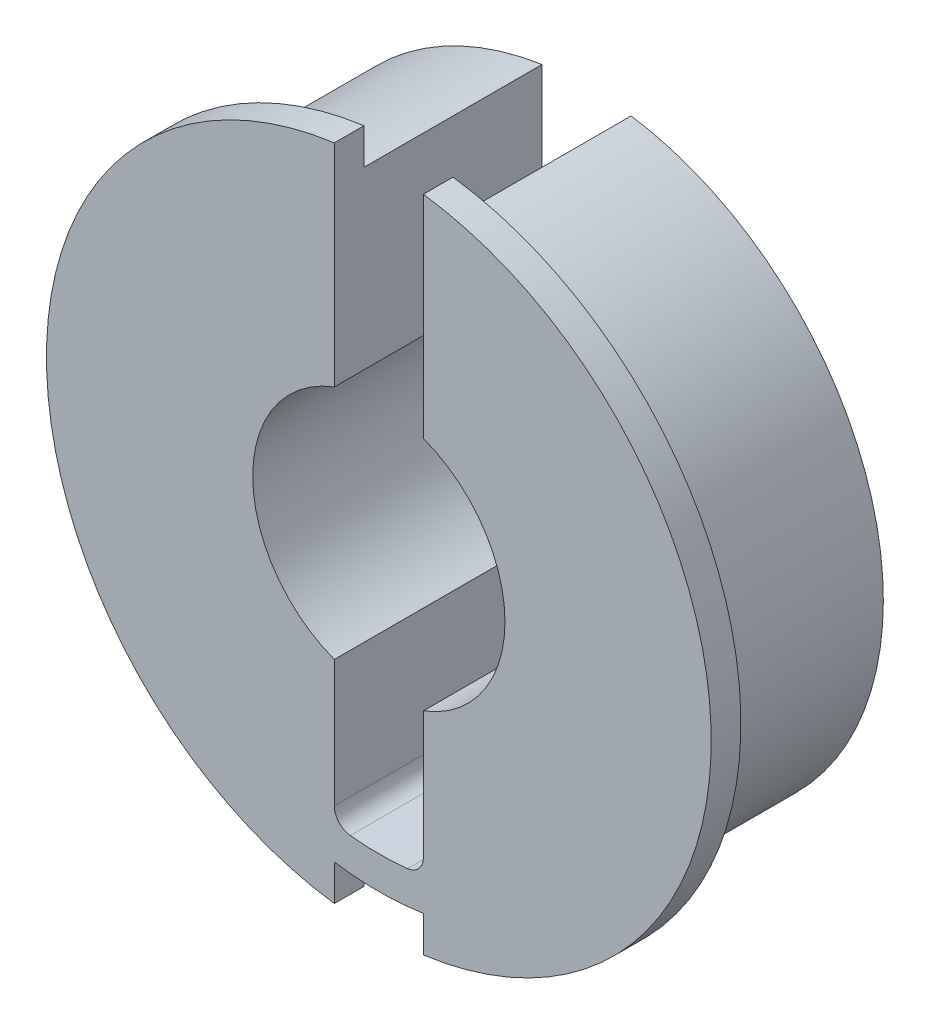
ISO-10303-21;
HEADER;
FILE_DESCRIPTION(('STEP AP214'),'2;1');
FILE_NAME('part.step','',(''),(''),'','','');
FILE_SCHEMA(('AUTOMOTIVE_DESIGN { 1 0 10303 214 1 1 1 1 }'));
ENDSEC;
DATA;
#1=APPLICATION_CONTEXT('core data for automotive mechanical design processes');
#2=APPLICATION_PROTOCOL_DEFINITION('international standard','automotive_design',2000,#1);
#3=PRODUCT_CONTEXT('',#1,'mechanical');
#4=PRODUCT('Part','Part','',(#3));
#5=PRODUCT_RELATED_PRODUCT_CATEGORY('part','',(#4));
#6=PRODUCT_DEFINITION_FORMATION('','',#4);
#7=PRODUCT_DEFINITION_CONTEXT('part definition',#1,'design');
#8=PRODUCT_DEFINITION('design','',#6,#7);
#9=PRODUCT_DEFINITION_SHAPE('','',#8);
#10=(LENGTH_UNIT() NAMED_UNIT(*) SI_UNIT(.MILLI.,.METRE.));
#11=(NAMED_UNIT(*) PLANE_ANGLE_UNIT() SI_UNIT($,.RADIAN.));
#12=(NAMED_UNIT(*) SI_UNIT($,.STERADIAN.) SOLID_ANGLE_UNIT());
#13=UNCERTAINTY_MEASURE_WITH_UNIT(LENGTH_MEASURE(1.E-05),#10,'distance_accuracy_value','');
#14=(GEOMETRIC_REPRESENTATION_CONTEXT(3) GLOBAL_UNCERTAINTY_ASSIGNED_CONTEXT((#13)) GLOBAL_UNIT_ASSIGNED_CONTEXT((#10,
#11,#12)) REPRESENTATION_CONTEXT('',''));
#15=CARTESIAN_POINT('',(0.,0.,0.));
#16=DIRECTION('',(0.,0.,1.));
#17=DIRECTION('',(1.,0.,0.));
#18=AXIS2_PLACEMENT_3D('',#15,#16,#17);
#19=CARTESIAN_POINT('',(0.,0.,7.62));
#20=DIRECTION('',(0.,0.,1.));
#21=DIRECTION('',(1.,0.,0.));
#22=AXIS2_PLACEMENT_3D('',#19,#20,#21);
#23=PLANE('',#22);
#24=CARTESIAN_POINT('',(0.,0.,7.62));
#25=DIRECTION('',(0.,0.,1.));
#26=DIRECTION('',(1.,0.,0.));
#27=AXIS2_PLACEMENT_3D('',#24,#25,#26);
#28=CIRCLE('',#27,14.224);
#29=CARTESIAN_POINT('',(1.905,-14.0958558094214,7.62));
#30=VERTEX_POINT('',#29);
#31=CARTESIAN_POINT('',(1.905,14.0958558094214,7.62));
#32=VERTEX_POINT('',#31);
#33=EDGE_CURVE('E227',#30,#32,#28,.T.);
#34=ORIENTED_EDGE('',*,*,#33,.F.);
#35=DIRECTION('',(0.,-1.,0.));
#36=VECTOR('',#35,1.);
#37=CARTESIAN_POINT('',(1.905,-14.224,7.62));
#38=LINE('',#37,#36);
#39=CARTESIAN_POINT('',(1.905,-12.5563121576361,7.62));
#40=VERTEX_POINT('',#39);
#41=EDGE_CURVE('E171',#40,#30,#38,.T.);
#42=ORIENTED_EDGE('',*,*,#41,.F.);
#43=CARTESIAN_POINT('',(0.,0.,7.62));
#44=DIRECTION('',(0.,0.,1.));
#45=DIRECTION('',(1.,0.,0.));
#46=AXIS2_PLACEMENT_3D('',#43,#44,#45);
#47=CIRCLE('',#46,12.7);
#48=CARTESIAN_POINT('',(1.905,12.5563121576361,7.62));
#49=VERTEX_POINT('',#48);
#50=EDGE_CURVE('E234',#40,#49,#47,.T.);
#51=ORIENTED_EDGE('',*,*,#50,.T.);
#52=DIRECTION('',(0.,1.,0.));
#53=VECTOR('',#52,1.);
#54=CARTESIAN_POINT('',(1.905,0.,7.62));
#55=LINE('',#54,#53);
#56=EDGE_CURVE('E188',#49,#32,#55,.T.);
#57=ORIENTED_EDGE('',*,*,#56,.T.);
#58=EDGE_LOOP('',(#34,#42,#51,#57));
#59=FACE_BOUND('',#58,.T.);
#60=ADVANCED_FACE('F33',(#59),#23,.F.);
#61=CARTESIAN_POINT('',(0.,0.,8.89));
#62=DIRECTION('',(0.,0.,-1.));
#63=DIRECTION('',(-1.,0.,0.));
#64=AXIS2_PLACEMENT_3D('',#61,#62,#63);
#65=CYLINDRICAL_SURFACE('',#64,14.224);
#66=CARTESIAN_POINT('',(0.,0.,8.89));
#67=DIRECTION('',(0.,0.,1.));
#68=DIRECTION('',(1.,0.,0.));
#69=AXIS2_PLACEMENT_3D('',#66,#67,#68);
#70=CIRCLE('',#69,14.224);
#71=CARTESIAN_POINT('',(1.905,-14.0958558094214,8.89));
#72=VERTEX_POINT('',#71);
#73=CARTESIAN_POINT('',(1.905,14.0958558094214,8.89));
#74=VERTEX_POINT('',#73);
#75=EDGE_CURVE('E223',#72,#74,#70,.T.);
#76=ORIENTED_EDGE('',*,*,#75,.F.);
#77=DIRECTION('',(0.,0.,-1.));
#78=VECTOR('',#77,1.);
#79=CARTESIAN_POINT('',(1.905,-14.0958558094214,8.89));
#80=LINE('',#79,#78);
#81=EDGE_CURVE('E245',#72,#30,#80,.T.);
#82=ORIENTED_EDGE('',*,*,#81,.T.);
#83=ORIENTED_EDGE('',*,*,#33,.T.);
#84=DIRECTION('',(0.,0.,-1.));
#85=VECTOR('',#84,1.);
#86=CARTESIAN_POINT('',(1.905,14.0958558094214,8.89));
#87=LINE('',#86,#85);
#88=EDGE_CURVE('E233',#32,#74,#87,.F.);
#89=ORIENTED_EDGE('',*,*,#88,.T.);
#90=EDGE_LOOP('',(#76,#82,#83,#89));
#91=FACE_BOUND('',#90,.T.);
#92=ADVANCED_FACE('F305',(#91),#65,.T.);
#93=CARTESIAN_POINT('',(0.,0.,7.62));
#94=DIRECTION('',(0.,0.,-1.));
#95=DIRECTION('',(-1.,0.,0.));
#96=AXIS2_PLACEMENT_3D('',#93,#94,#95);
#97=CYLINDRICAL_SURFACE('',#96,5.3975);
#98=DIRECTION('',(0.,0.,-1.));
#99=VECTOR('',#98,1.);
#100=CARTESIAN_POINT('',(-1.905,5.05014665628633,7.62));
#101=LINE('',#100,#99);
#102=CARTESIAN_POINT('',(-1.905,5.05014665628633,8.89));
#103=VERTEX_POINT('',#102);
#104=CARTESIAN_POINT('',(-1.905,5.05014665628633,0.));
#105=VERTEX_POINT('',#104);
#106=EDGE_CURVE('E215',#103,#105,#101,.T.);
#107=ORIENTED_EDGE('',*,*,#106,.F.);
#108=CARTESIAN_POINT('',(0.,0.,8.89));
#109=DIRECTION('',(0.,0.,1.));
#110=DIRECTION('',(1.,0.,0.));
#111=AXIS2_PLACEMENT_3D('',#108,#109,#110);
#112=CIRCLE('',#111,5.3975);
#113=CARTESIAN_POINT('',(-1.905,-5.05014665628632,8.89));
#114=VERTEX_POINT('',#113);
#115=EDGE_CURVE('E220',#103,#114,#112,.T.);
#116=ORIENTED_EDGE('',*,*,#115,.T.);
#117=DIRECTION('',(0.,0.,-1.));
#118=VECTOR('',#117,1.);
#119=CARTESIAN_POINT('',(-1.905,-5.05014665628633,7.62));
#120=LINE('',#119,#118);
#121=CARTESIAN_POINT('',(-1.905,-5.05014665628633,0.));
#122=VERTEX_POINT('',#121);
#123=EDGE_CURVE('E212',#122,#114,#120,.F.);
#124=ORIENTED_EDGE('',*,*,#123,.F.);
#125=CARTESIAN_POINT('',(0.,0.,0.));
#126=DIRECTION('',(0.,0.,1.));
#127=DIRECTION('',(1.,0.,0.));
#128=AXIS2_PLACEMENT_3D('',#125,#126,#127);
#129=CIRCLE('',#128,5.3975);
#130=EDGE_CURVE('E230',#105,#122,#129,.T.);
#131=ORIENTED_EDGE('',*,*,#130,.F.);
#132=EDGE_LOOP('',(#107,#116,#124,#131));
#133=FACE_BOUND('',#132,.T.);
#134=ADVANCED_FACE('F326',(#133),#97,.F.);
#135=CARTESIAN_POINT('',(0.,0.,0.));
#136=DIRECTION('',(0.,0.,1.));
#137=DIRECTION('',(1.,0.,0.));
#138=AXIS2_PLACEMENT_3D('',#135,#136,#137);
#139=PLANE('',#138);
#140=CARTESIAN_POINT('',(0.,0.,0.));
#141=DIRECTION('',(0.,0.,1.));
#142=DIRECTION('',(1.,0.,0.));
#143=AXIS2_PLACEMENT_3D('',#140,#141,#142);
#144=CIRCLE('',#143,12.7);
#145=CARTESIAN_POINT('',(-1.905,12.5563121576361,0.));
#146=VERTEX_POINT('',#145);
#147=CARTESIAN_POINT('',(1.905,12.5563121576361,0.));
#148=VERTEX_POINT('',#147);
#149=EDGE_CURVE('E235',#146,#148,#144,.T.);
#150=ORIENTED_EDGE('',*,*,#149,.F.);
#151=DIRECTION('',(0.,1.,0.));
#152=VECTOR('',#151,1.);
#153=CARTESIAN_POINT('',(-1.905,14.224,0.));
#154=LINE('',#153,#152);
#155=EDGE_CURVE('E177',#105,#146,#154,.T.);
#156=ORIENTED_EDGE('',*,*,#155,.F.);
#157=ORIENTED_EDGE('',*,*,#130,.T.);
#158=CARTESIAN_POINT('',(-1.905,-10.478846883126,0.));
#159=VERTEX_POINT('',#158);
#160=EDGE_CURVE('E189',#159,#122,#154,.T.);
#161=ORIENTED_EDGE('',*,*,#160,.F.);
#162=CARTESIAN_POINT('',(-1.143,-10.478846883126,0.));
#163=DIRECTION('',(0.,0.,1.));
#164=DIRECTION('',(1.,0.,0.));
#165=AXIS2_PLACEMENT_3D('',#162,#163,#164);
#166=CIRCLE('',#165,0.762);
#167=CARTESIAN_POINT('',(-1.2256265060241,-11.2363538867255,0.));
#168=VERTEX_POINT('',#167);
#169=EDGE_CURVE('E257',#159,#168,#166,.T.);
#170=ORIENTED_EDGE('',*,*,#169,.T.);
#171=CARTESIAN_POINT('',(0.,1.64798730217797E-13,0.));
#172=DIRECTION('',(0.,0.,-1.));
#173=DIRECTION('',(-1.,0.,0.));
#174=AXIS2_PLACEMENT_3D('',#171,#172,#173);
#175=CIRCLE('',#174,11.3030000000002);
#176=CARTESIAN_POINT('',(1.2256265060241,-11.2363538867255,0.));
#177=VERTEX_POINT('',#176);
#178=EDGE_CURVE('E194',#177,#168,#175,.T.);
#179=ORIENTED_EDGE('',*,*,#178,.F.);
#180=CARTESIAN_POINT('',(1.143,-10.478846883126,0.));
#181=DIRECTION('',(0.,0.,1.));
#182=DIRECTION('',(1.,0.,0.));
#183=AXIS2_PLACEMENT_3D('',#180,#181,#182);
#184=CIRCLE('',#183,0.762);
#185=CARTESIAN_POINT('',(1.905,-10.478846883126,0.));
#186=VERTEX_POINT('',#185);
#187=EDGE_CURVE('E41',#177,#186,#184,.T.);
#188=ORIENTED_EDGE('',*,*,#187,.T.);
#189=DIRECTION('',(0.,-1.,0.));
#190=VECTOR('',#189,1.);
#191=CARTESIAN_POINT('',(1.905,14.224,0.));
#192=LINE('',#191,#190);
#193=CARTESIAN_POINT('',(1.905,-5.05014665628633,0.));
#194=VERTEX_POINT('',#193);
#195=EDGE_CURVE('E191',#194,#186,#192,.T.);
#196=ORIENTED_EDGE('',*,*,#195,.F.);
#197=CARTESIAN_POINT('',(1.905,5.05014665628633,0.));
#198=VERTEX_POINT('',#197);
#199=EDGE_CURVE('E222',#194,#198,#129,.T.);
#200=ORIENTED_EDGE('',*,*,#199,.T.);
#201=EDGE_CURVE('E193',#148,#198,#192,.T.);
#202=ORIENTED_EDGE('',*,*,#201,.F.);
#203=EDGE_LOOP('',(#150,#156,#157,#161,#170,#179,#188,#196,#200,#202));
#204=FACE_BOUND('',#203,.T.);
#205=ADVANCED_FACE('F274',(#204),#139,.F.);
#206=CARTESIAN_POINT('',(0.,0.,7.62));
#207=DIRECTION('',(0.,0.,-1.));
#208=DIRECTION('',(-1.,0.,0.));
#209=AXIS2_PLACEMENT_3D('',#206,#207,#208);
#210=CYLINDRICAL_SURFACE('',#209,12.7);
#211=CARTESIAN_POINT('',(-1.905,12.5563121576361,7.62));
#212=VERTEX_POINT('',#211);
#213=CARTESIAN_POINT('',(-1.905,-12.5563121576361,7.62));
#214=VERTEX_POINT('',#213);
#215=EDGE_CURVE('E231',#212,#214,#47,.T.);
#216=ORIENTED_EDGE('',*,*,#215,.F.);
#217=DIRECTION('',(0.,0.,-1.));
#218=VECTOR('',#217,1.);
#219=CARTESIAN_POINT('',(-1.905,12.5563121576361,7.62));
#220=LINE('',#219,#218);
#221=EDGE_CURVE('E209',#212,#146,#220,.T.);
#222=ORIENTED_EDGE('',*,*,#221,.T.);
#223=ORIENTED_EDGE('',*,*,#149,.T.);
#224=DIRECTION('',(0.,0.,-1.));
#225=VECTOR('',#224,1.);
#226=CARTESIAN_POINT('',(1.905,12.5563121576361,7.62));
#227=LINE('',#226,#225);
#228=EDGE_CURVE('E199',#148,#49,#227,.F.);
#229=ORIENTED_EDGE('',*,*,#228,.T.);
#230=ORIENTED_EDGE('',*,*,#50,.F.);
#231=DIRECTION('',(0.,0.,-1.));
#232=VECTOR('',#231,1.);
#233=CARTESIAN_POINT('',(1.905,-12.5563121576361,8.89));
#234=LINE('',#233,#232);
#235=CARTESIAN_POINT('',(1.905,-12.5563121576361,8.89));
#236=VERTEX_POINT('',#235);
#237=EDGE_CURVE('E155',#236,#40,#234,.T.);
#238=ORIENTED_EDGE('',*,*,#237,.F.);
#239=CARTESIAN_POINT('',(0.,0.,8.89));
#240=DIRECTION('',(0.,0.,1.));
#241=DIRECTION('',(-1.,0.,0.));
#242=AXIS2_PLACEMENT_3D('',#239,#240,#241);
#243=CIRCLE('',#242,12.7);
#244=CARTESIAN_POINT('',(-1.905,-12.5563121576361,8.89));
#245=VERTEX_POINT('',#244);
#246=EDGE_CURVE('E159',#245,#236,#243,.T.);
#247=ORIENTED_EDGE('',*,*,#246,.F.);
#248=DIRECTION('',(0.,0.,-1.));
#249=VECTOR('',#248,1.);
#250=CARTESIAN_POINT('',(-1.905,-12.5563121576361,8.89));
#251=LINE('',#250,#249);
#252=EDGE_CURVE('E144',#245,#214,#251,.T.);
#253=ORIENTED_EDGE('',*,*,#252,.T.);
#254=EDGE_LOOP('',(#216,#222,#223,#229,#230,#238,#247,#253));
#255=FACE_BOUND('',#254,.T.);
#256=ADVANCED_FACE('F160',(#255),#210,.T.);
#257=DIRECTION('',(0.,0.,-1.));
#258=VECTOR('',#257,1.);
#259=CARTESIAN_POINT('',(1.905,-5.05014665628633,7.62));
#260=LINE('',#259,#258);
#261=CARTESIAN_POINT('',(1.905,-5.05014665628632,8.89));
#262=VERTEX_POINT('',#261);
#263=EDGE_CURVE('E204',#262,#194,#260,.T.);
#264=ORIENTED_EDGE('',*,*,#263,.F.);
#265=CARTESIAN_POINT('',(1.905,5.05014665628633,8.89));
#266=VERTEX_POINT('',#265);
#267=EDGE_CURVE('E217',#262,#266,#112,.T.);
#268=ORIENTED_EDGE('',*,*,#267,.T.);
#269=DIRECTION('',(0.,0.,-1.));
#270=VECTOR('',#269,1.);
#271=CARTESIAN_POINT('',(1.905,5.05014665628633,7.62));
#272=LINE('',#271,#270);
#273=EDGE_CURVE('E202',#198,#266,#272,.F.);
#274=ORIENTED_EDGE('',*,*,#273,.F.);
#275=ORIENTED_EDGE('',*,*,#199,.F.);
#276=EDGE_LOOP('',(#264,#268,#274,#275));
#277=FACE_BOUND('',#276,.T.);
#278=ADVANCED_FACE('F287',(#277),#97,.F.);
#279=ORIENTED_EDGE('',*,*,#215,.T.);
#280=DIRECTION('',(0.,1.,0.));
#281=VECTOR('',#280,1.);
#282=CARTESIAN_POINT('',(-1.905,-12.5563121576361,7.62));
#283=LINE('',#282,#281);
#284=CARTESIAN_POINT('',(-1.905,-14.0958558094214,7.62));
#285=VERTEX_POINT('',#284);
#286=EDGE_CURVE('E151',#285,#214,#283,.T.);
#287=ORIENTED_EDGE('',*,*,#286,.F.);
#288=CARTESIAN_POINT('',(-1.905,14.0958558094214,7.62));
#289=VERTEX_POINT('',#288);
#290=EDGE_CURVE('E224',#289,#285,#28,.T.);
#291=ORIENTED_EDGE('',*,*,#290,.F.);
#292=DIRECTION('',(0.,-1.,0.));
#293=VECTOR('',#292,1.);
#294=CARTESIAN_POINT('',(-1.905,0.,7.62));
#295=LINE('',#294,#293);
#296=EDGE_CURVE('E206',#289,#212,#295,.T.);
#297=ORIENTED_EDGE('',*,*,#296,.T.);
#298=EDGE_LOOP('',(#279,#287,#291,#297));
#299=FACE_BOUND('',#298,.T.);
#300=ADVANCED_FACE('F296',(#299),#23,.F.);
#301=CARTESIAN_POINT('',(0.,0.,8.89));
#302=DIRECTION('',(0.,0.,1.));
#303=DIRECTION('',(1.,0.,0.));
#304=AXIS2_PLACEMENT_3D('',#301,#302,#303);
#305=PLANE('',#304);
#306=DIRECTION('',(0.,-1.,0.));
#307=VECTOR('',#306,1.);
#308=CARTESIAN_POINT('',(1.905,-14.224,8.89));
#309=LINE('',#308,#307);
#310=EDGE_CURVE('E156',#236,#72,#309,.T.);
#311=ORIENTED_EDGE('',*,*,#310,.T.);
#312=ORIENTED_EDGE('',*,*,#75,.T.);
#313=DIRECTION('',(0.,-1.,0.));
#314=VECTOR('',#313,1.);
#315=CARTESIAN_POINT('',(1.905,14.224,8.89));
#316=LINE('',#315,#314);
#317=EDGE_CURVE('E184',#74,#266,#316,.T.);
#318=ORIENTED_EDGE('',*,*,#317,.T.);
#319=ORIENTED_EDGE('',*,*,#267,.F.);
#320=CARTESIAN_POINT('',(1.905,-10.478846883126,8.89));
#321=VERTEX_POINT('',#320);
#322=EDGE_CURVE('E181',#262,#321,#316,.T.);
#323=ORIENTED_EDGE('',*,*,#322,.T.);
#324=CARTESIAN_POINT('',(1.143,-10.478846883126,8.89));
#325=DIRECTION('',(0.,0.,1.));
#326=DIRECTION('',(1.,0.,0.));
#327=AXIS2_PLACEMENT_3D('',#324,#325,#326);
#328=CIRCLE('',#327,0.762);
#329=CARTESIAN_POINT('',(1.2256265060241,-11.2363538867255,8.89));
#330=VERTEX_POINT('',#329);
#331=EDGE_CURVE('E11',#321,#330,#328,.F.);
#332=ORIENTED_EDGE('',*,*,#331,.T.);
#333=CARTESIAN_POINT('',(0.,1.64798730217797E-13,8.89));
#334=DIRECTION('',(0.,0.,-1.));
#335=DIRECTION('',(-1.,0.,0.));
#336=AXIS2_PLACEMENT_3D('',#333,#334,#335);
#337=CIRCLE('',#336,11.3030000000002);
#338=CARTESIAN_POINT('',(-1.2256265060241,-11.2363538867255,8.89));
#339=VERTEX_POINT('',#338);
#340=EDGE_CURVE('E185',#330,#339,#337,.T.);
#341=ORIENTED_EDGE('',*,*,#340,.T.);
#342=CARTESIAN_POINT('',(-1.143,-10.478846883126,8.89));
#343=DIRECTION('',(0.,0.,1.));
#344=DIRECTION('',(1.,0.,0.));
#345=AXIS2_PLACEMENT_3D('',#342,#343,#344);
#346=CIRCLE('',#345,0.762);
#347=CARTESIAN_POINT('',(-1.905,-10.478846883126,8.89));
#348=VERTEX_POINT('',#347);
#349=EDGE_CURVE('E259',#339,#348,#346,.F.);
#350=ORIENTED_EDGE('',*,*,#349,.T.);
#351=DIRECTION('',(0.,1.,0.));
#352=VECTOR('',#351,1.);
#353=CARTESIAN_POINT('',(-1.905,14.224,8.89));
#354=LINE('',#353,#352);
#355=EDGE_CURVE('E179',#348,#114,#354,.T.);
#356=ORIENTED_EDGE('',*,*,#355,.T.);
#357=ORIENTED_EDGE('',*,*,#115,.F.);
#358=CARTESIAN_POINT('',(-1.905,14.0958558094214,8.89));
#359=VERTEX_POINT('',#358);
#360=EDGE_CURVE('E182',#103,#359,#354,.T.);
#361=ORIENTED_EDGE('',*,*,#360,.T.);
#362=CARTESIAN_POINT('',(-1.905,-14.0958558094214,8.89));
#363=VERTEX_POINT('',#362);
#364=EDGE_CURVE('E170',#359,#363,#70,.T.);
#365=ORIENTED_EDGE('',*,*,#364,.T.);
#366=DIRECTION('',(0.,1.,0.));
#367=VECTOR('',#366,1.);
#368=CARTESIAN_POINT('',(-1.905,-12.5563121576361,8.89));
#369=LINE('',#368,#367);
#370=EDGE_CURVE('E148',#363,#245,#369,.T.);
#371=ORIENTED_EDGE('',*,*,#370,.T.);
#372=ORIENTED_EDGE('',*,*,#246,.T.);
#373=EDGE_LOOP('',(#311,#312,#318,#319,#323,#332,#341,#350,#356,#357,#361,#365,#371,#372));
#374=FACE_BOUND('',#373,.T.);
#375=ADVANCED_FACE('F167',(#374),#305,.T.);
#376=ORIENTED_EDGE('',*,*,#290,.T.);
#377=DIRECTION('',(0.,0.,-1.));
#378=VECTOR('',#377,1.);
#379=CARTESIAN_POINT('',(-1.905,-14.0958558094214,8.89));
#380=LINE('',#379,#378);
#381=EDGE_CURVE('E243',#285,#363,#380,.F.);
#382=ORIENTED_EDGE('',*,*,#381,.T.);
#383=ORIENTED_EDGE('',*,*,#364,.F.);
#384=DIRECTION('',(0.,0.,-1.));
#385=VECTOR('',#384,1.);
#386=CARTESIAN_POINT('',(-1.905,14.0958558094214,8.89));
#387=LINE('',#386,#385);
#388=EDGE_CURVE('E240',#359,#289,#387,.T.);
#389=ORIENTED_EDGE('',*,*,#388,.T.);
#390=EDGE_LOOP('',(#376,#382,#383,#389));
#391=FACE_BOUND('',#390,.T.);
#392=ADVANCED_FACE('F298',(#391),#65,.T.);
#393=CARTESIAN_POINT('',(1.905,14.224,8.89));
#394=DIRECTION('',(1.,0.,0.));
#395=DIRECTION('',(0.,1.,0.));
#396=AXIS2_PLACEMENT_3D('',#393,#394,#395);
#397=PLANE('',#396);
#398=ORIENTED_EDGE('',*,*,#273,.T.);
#399=ORIENTED_EDGE('',*,*,#317,.F.);
#400=ORIENTED_EDGE('',*,*,#88,.F.);
#401=ORIENTED_EDGE('',*,*,#56,.F.);
#402=ORIENTED_EDGE('',*,*,#228,.F.);
#403=ORIENTED_EDGE('',*,*,#201,.T.);
#404=EDGE_LOOP('',(#398,#399,#400,#401,#402,#403));
#405=FACE_BOUND('',#404,.T.);
#406=ADVANCED_FACE('F310',(#405),#397,.F.);
#407=CARTESIAN_POINT('',(-1.905,14.224,8.89));
#408=DIRECTION('',(-1.,0.,0.));
#409=DIRECTION('',(0.,-1.,0.));
#410=AXIS2_PLACEMENT_3D('',#407,#408,#409);
#411=PLANE('',#410);
#412=ORIENTED_EDGE('',*,*,#106,.T.);
#413=ORIENTED_EDGE('',*,*,#155,.T.);
#414=ORIENTED_EDGE('',*,*,#221,.F.);
#415=ORIENTED_EDGE('',*,*,#296,.F.);
#416=ORIENTED_EDGE('',*,*,#388,.F.);
#417=ORIENTED_EDGE('',*,*,#360,.F.);
#418=EDGE_LOOP('',(#412,#413,#414,#415,#416,#417));
#419=FACE_BOUND('',#418,.T.);
#420=ADVANCED_FACE('F293',(#419),#411,.F.);
#421=ORIENTED_EDGE('',*,*,#355,.F.);
#422=DIRECTION('',(0.,0.,1.));
#423=VECTOR('',#422,1.);
#424=CARTESIAN_POINT('',(-1.905,-10.478846883126,0.));
#425=LINE('',#424,#423);
#426=EDGE_CURVE('E248',#348,#159,#425,.F.);
#427=ORIENTED_EDGE('',*,*,#426,.T.);
#428=ORIENTED_EDGE('',*,*,#160,.T.);
#429=ORIENTED_EDGE('',*,*,#123,.T.);
#430=EDGE_LOOP('',(#421,#427,#428,#429));
#431=FACE_BOUND('',#430,.T.);
#432=ADVANCED_FACE('F268',(#431),#411,.F.);
#433=ORIENTED_EDGE('',*,*,#195,.T.);
#434=DIRECTION('',(0.,0.,1.));
#435=VECTOR('',#434,1.);
#436=CARTESIAN_POINT('',(1.905,-10.478846883126,8.89));
#437=LINE('',#436,#435);
#438=EDGE_CURVE('E48',#186,#321,#437,.T.);
#439=ORIENTED_EDGE('',*,*,#438,.T.);
#440=ORIENTED_EDGE('',*,*,#322,.F.);
#441=ORIENTED_EDGE('',*,*,#263,.T.);
#442=EDGE_LOOP('',(#433,#439,#440,#441));
#443=FACE_BOUND('',#442,.T.);
#444=ADVANCED_FACE('F284',(#443),#397,.F.);
#445=CARTESIAN_POINT('',(0.,1.64798730217797E-13,8.89));
#446=DIRECTION('',(0.,0.,-1.));
#447=DIRECTION('',(-1.,0.,0.));
#448=AXIS2_PLACEMENT_3D('',#445,#446,#447);
#449=CYLINDRICAL_SURFACE('',#448,11.3030000000002);
#450=ORIENTED_EDGE('',*,*,#178,.T.);
#451=DIRECTION('',(0.,0.,-1.));
#452=VECTOR('',#451,1.);
#453=CARTESIAN_POINT('',(-1.2256265060241,-11.2363538867255,8.89));
#454=LINE('',#453,#452);
#455=EDGE_CURVE('E254',#168,#339,#454,.F.);
#456=ORIENTED_EDGE('',*,*,#455,.T.);
#457=ORIENTED_EDGE('',*,*,#340,.F.);
#458=DIRECTION('',(0.,0.,-1.));
#459=VECTOR('',#458,1.);
#460=CARTESIAN_POINT('',(1.2256265060241,-11.2363538867255,8.89));
#461=LINE('',#460,#459);
#462=EDGE_CURVE('E251',#330,#177,#461,.T.);
#463=ORIENTED_EDGE('',*,*,#462,.T.);
#464=EDGE_LOOP('',(#450,#456,#457,#463));
#465=FACE_BOUND('',#464,.T.);
#466=ADVANCED_FACE('F277',(#465),#449,.F.);
#467=CARTESIAN_POINT('',(1.905,-14.224,8.89));
#468=DIRECTION('',(1.,0.,0.));
#469=DIRECTION('',(0.,1.,0.));
#470=AXIS2_PLACEMENT_3D('',#467,#468,#469);
#471=PLANE('',#470);
#472=ORIENTED_EDGE('',*,*,#310,.F.);
#473=ORIENTED_EDGE('',*,*,#237,.T.);
#474=ORIENTED_EDGE('',*,*,#41,.T.);
#475=ORIENTED_EDGE('',*,*,#81,.F.);
#476=EDGE_LOOP('',(#472,#473,#474,#475));
#477=FACE_BOUND('',#476,.T.);
#478=ADVANCED_FACE('F312',(#477),#471,.F.);
#479=CARTESIAN_POINT('',(-1.905,-12.5563121576361,8.89));
#480=DIRECTION('',(-1.,0.,0.));
#481=DIRECTION('',(0.,-1.,0.));
#482=AXIS2_PLACEMENT_3D('',#479,#480,#481);
#483=PLANE('',#482);
#484=ORIENTED_EDGE('',*,*,#286,.T.);
#485=ORIENTED_EDGE('',*,*,#252,.F.);
#486=ORIENTED_EDGE('',*,*,#370,.F.);
#487=ORIENTED_EDGE('',*,*,#381,.F.);
#488=EDGE_LOOP('',(#484,#485,#486,#487));
#489=FACE_BOUND('',#488,.T.);
#490=ADVANCED_FACE('F146',(#489),#483,.F.);
#491=CARTESIAN_POINT('',(-1.143,-10.478846883126,8.89));
#492=DIRECTION('',(0.,0.,-1.));
#493=DIRECTION('',(-1.,0.,0.));
#494=AXIS2_PLACEMENT_3D('',#491,#492,#493);
#495=CYLINDRICAL_SURFACE('',#494,0.762);
#496=ORIENTED_EDGE('',*,*,#349,.F.);
#497=ORIENTED_EDGE('',*,*,#455,.F.);
#498=ORIENTED_EDGE('',*,*,#169,.F.);
#499=ORIENTED_EDGE('',*,*,#426,.F.);
#500=EDGE_LOOP('',(#496,#497,#498,#499));
#501=FACE_BOUND('',#500,.T.);
#502=ADVANCED_FACE('F272',(#501),#495,.F.);
#503=CARTESIAN_POINT('',(1.143,-10.478846883126,8.89));
#504=DIRECTION('',(0.,0.,-1.));
#505=DIRECTION('',(-1.,0.,0.));
#506=AXIS2_PLACEMENT_3D('',#503,#504,#505);
#507=CYLINDRICAL_SURFACE('',#506,0.762);
#508=ORIENTED_EDGE('',*,*,#331,.F.);
#509=ORIENTED_EDGE('',*,*,#438,.F.);
#510=ORIENTED_EDGE('',*,*,#187,.F.);
#511=ORIENTED_EDGE('',*,*,#462,.F.);
#512=EDGE_LOOP('',(#508,#509,#510,#511));
#513=FACE_BOUND('',#512,.T.);
#514=ADVANCED_FACE('F35',(#513),#507,.F.);
#515=CLOSED_SHELL('',(#60,#92,#134,#205,#256,#278,#300,#375,#392,#406,#420,#432,#444,#466,#478,
#490,#502,#514));
#516=MANIFOLD_SOLID_BREP('B2',#515);
#517=ADVANCED_BREP_SHAPE_REPRESENTATION('',(#18,#516),#14);
#518=SHAPE_DEFINITION_REPRESENTATION(#9,#517);
ENDSEC;
END-ISO-10303-21;
